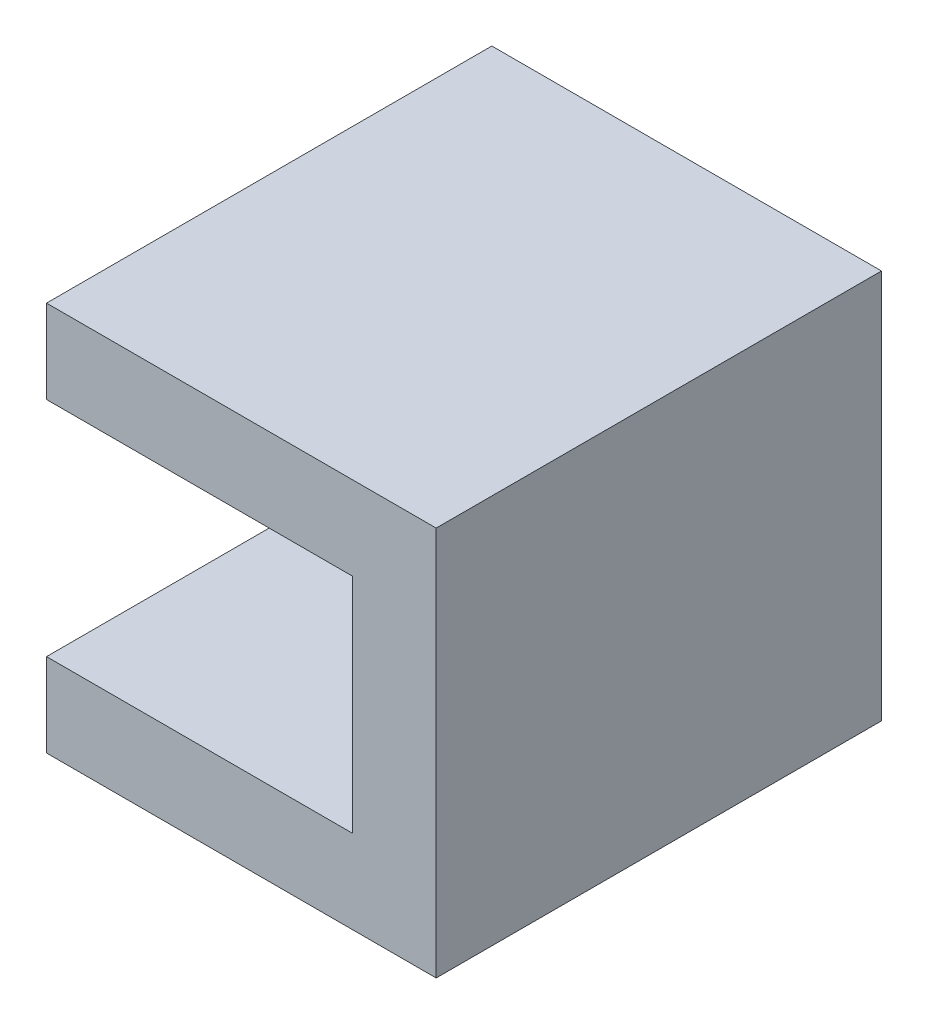
ISO-10303-21;
HEADER;
FILE_DESCRIPTION(('STEP AP214'),'2;1');
FILE_NAME('part.step','',(''),(''),'','','');
FILE_SCHEMA(('AUTOMOTIVE_DESIGN { 1 0 10303 214 1 1 1 1 }'));
ENDSEC;
DATA;
#1=APPLICATION_CONTEXT('core data for automotive mechanical design processes');
#2=APPLICATION_PROTOCOL_DEFINITION('international standard','automotive_design',2000,#1);
#3=PRODUCT_CONTEXT('',#1,'mechanical');
#4=PRODUCT('Part','Part','',(#3));
#5=PRODUCT_RELATED_PRODUCT_CATEGORY('part','',(#4));
#6=PRODUCT_DEFINITION_FORMATION('','',#4);
#7=PRODUCT_DEFINITION_CONTEXT('part definition',#1,'design');
#8=PRODUCT_DEFINITION('design','',#6,#7);
#9=PRODUCT_DEFINITION_SHAPE('','',#8);
#10=(LENGTH_UNIT() NAMED_UNIT(*) SI_UNIT(.MILLI.,.METRE.));
#11=(NAMED_UNIT(*) PLANE_ANGLE_UNIT() SI_UNIT($,.RADIAN.));
#12=(NAMED_UNIT(*) SI_UNIT($,.STERADIAN.) SOLID_ANGLE_UNIT());
#13=UNCERTAINTY_MEASURE_WITH_UNIT(LENGTH_MEASURE(1.E-05),#10,'distance_accuracy_value','');
#14=(GEOMETRIC_REPRESENTATION_CONTEXT(3) GLOBAL_UNCERTAINTY_ASSIGNED_CONTEXT((#13)) GLOBAL_UNIT_ASSIGNED_CONTEXT((#10,
#11,#12)) REPRESENTATION_CONTEXT('',''));
#15=CARTESIAN_POINT('',(0.,0.,0.));
#16=DIRECTION('',(0.,0.,1.));
#17=DIRECTION('',(1.,0.,0.));
#18=AXIS2_PLACEMENT_3D('',#15,#16,#17);
#19=CARTESIAN_POINT('',(3.175,0.,25.4));
#20=DIRECTION('',(0.,-1.,0.));
#21=DIRECTION('',(0.,0.,-1.));
#22=AXIS2_PLACEMENT_3D('',#19,#20,#21);
#23=PLANE('',#22);
#24=DIRECTION('',(0.,0.,-1.));
#25=VECTOR('',#24,1.);
#26=CARTESIAN_POINT('',(3.175,0.,25.4));
#27=LINE('',#26,#25);
#28=CARTESIAN_POINT('',(3.175,0.,3.175));
#29=VERTEX_POINT('',#28);
#30=CARTESIAN_POINT('',(3.175,0.,-3.175));
#31=VERTEX_POINT('',#30);
#32=EDGE_CURVE('E172',#29,#31,#27,.T.);
#33=ORIENTED_EDGE('',*,*,#32,.T.);
#34=CARTESIAN_POINT('',(3.175,0.,0.));
#35=DIRECTION('',(0.,-1.,0.));
#36=DIRECTION('',(0.,0.,1.));
#37=AXIS2_PLACEMENT_3D('',#34,#35,#36);
#38=CIRCLE('',#37,3.175);
#39=EDGE_CURVE('E234',#29,#31,#38,.T.);
#40=ORIENTED_EDGE('',*,*,#39,.F.);
#41=EDGE_LOOP('',(#33,#40));
#42=FACE_BOUND('',#41,.T.);
#43=ADVANCED_FACE('F37',(#42),#23,.F.);
#44=CARTESIAN_POINT('',(0.,-6.35,25.4));
#45=DIRECTION('',(0.,1.,0.));
#46=DIRECTION('',(0.,0.,1.));
#47=AXIS2_PLACEMENT_3D('',#44,#45,#46);
#48=PLANE('',#47);
#49=CARTESIAN_POINT('',(3.175,-6.35,0.));
#50=DIRECTION('',(0.,1.,0.));
#51=DIRECTION('',(0.,0.,1.));
#52=AXIS2_PLACEMENT_3D('',#49,#50,#51);
#53=CIRCLE('',#52,3.175);
#54=CARTESIAN_POINT('',(3.175,-6.35,-3.175));
#55=VERTEX_POINT('',#54);
#56=CARTESIAN_POINT('',(3.175,-6.35,3.175));
#57=VERTEX_POINT('',#56);
#58=EDGE_CURVE('E228',#55,#57,#53,.T.);
#59=ORIENTED_EDGE('',*,*,#58,.F.);
#60=DIRECTION('',(0.,0.,-1.));
#61=VECTOR('',#60,1.);
#62=CARTESIAN_POINT('',(3.175,-6.35,25.4));
#63=LINE('',#62,#61);
#64=EDGE_CURVE('E169',#57,#55,#63,.T.);
#65=ORIENTED_EDGE('',*,*,#64,.F.);
#66=EDGE_LOOP('',(#59,#65));
#67=FACE_BOUND('',#66,.T.);
#68=ADVANCED_FACE('F260',(#67),#48,.F.);
#69=CARTESIAN_POINT('',(0.,0.,-25.4));
#70=DIRECTION('',(0.,0.,1.));
#71=DIRECTION('',(1.,0.,0.));
#72=AXIS2_PLACEMENT_3D('',#69,#70,#71);
#73=PLANE('',#72);
#74=DIRECTION('',(0.,-1.,0.));
#75=VECTOR('',#74,1.);
#76=CARTESIAN_POINT('',(3.175,-6.35,-25.4));
#77=LINE('',#76,#75);
#78=CARTESIAN_POINT('',(3.175,12.7,-25.4));
#79=VERTEX_POINT('',#78);
#80=CARTESIAN_POINT('',(3.175,-12.7,-25.4));
#81=VERTEX_POINT('',#80);
#82=EDGE_CURVE('E148',#79,#81,#77,.T.);
#83=ORIENTED_EDGE('',*,*,#82,.F.);
#84=DIRECTION('',(1.,0.,0.));
#85=VECTOR('',#84,1.);
#86=CARTESIAN_POINT('',(-11.1125,12.7,-25.4));
#87=LINE('',#86,#85);
#88=CARTESIAN_POINT('',(-31.75,12.7,-25.4));
#89=VERTEX_POINT('',#88);
#90=EDGE_CURVE('E145',#89,#79,#87,.T.);
#91=ORIENTED_EDGE('',*,*,#90,.F.);
#92=DIRECTION('',(0.,-1.,0.));
#93=VECTOR('',#92,1.);
#94=CARTESIAN_POINT('',(-31.75,22.225,-25.4));
#95=LINE('',#94,#93);
#96=CARTESIAN_POINT('',(-31.75,22.225,-25.4));
#97=VERTEX_POINT('',#96);
#98=EDGE_CURVE('E141',#97,#89,#95,.T.);
#99=ORIENTED_EDGE('',*,*,#98,.F.);
#100=DIRECTION('',(-1.,0.,0.));
#101=VECTOR('',#100,1.);
#102=CARTESIAN_POINT('',(12.7,22.225,-25.4));
#103=LINE('',#102,#101);
#104=CARTESIAN_POINT('',(12.7,22.225,-25.4));
#105=VERTEX_POINT('',#104);
#106=EDGE_CURVE('E138',#105,#97,#103,.T.);
#107=ORIENTED_EDGE('',*,*,#106,.F.);
#108=DIRECTION('',(0.,1.,0.));
#109=VECTOR('',#108,1.);
#110=CARTESIAN_POINT('',(12.7,-22.225,-25.4));
#111=LINE('',#110,#109);
#112=CARTESIAN_POINT('',(12.7,-22.225,-25.4));
#113=VERTEX_POINT('',#112);
#114=EDGE_CURVE('E90',#113,#105,#111,.T.);
#115=ORIENTED_EDGE('',*,*,#114,.F.);
#116=DIRECTION('',(1.,0.,0.));
#117=VECTOR('',#116,1.);
#118=CARTESIAN_POINT('',(-31.75,-22.225,-25.4));
#119=LINE('',#118,#117);
#120=CARTESIAN_POINT('',(-31.75,-22.225,-25.4));
#121=VERTEX_POINT('',#120);
#122=EDGE_CURVE('E84',#121,#113,#119,.T.);
#123=ORIENTED_EDGE('',*,*,#122,.F.);
#124=DIRECTION('',(0.,-1.,0.));
#125=VECTOR('',#124,1.);
#126=CARTESIAN_POINT('',(-31.75,-12.7,-25.4));
#127=LINE('',#126,#125);
#128=CARTESIAN_POINT('',(-31.75,-12.7,-25.4));
#129=VERTEX_POINT('',#128);
#130=EDGE_CURVE('E128',#129,#121,#127,.T.);
#131=ORIENTED_EDGE('',*,*,#130,.F.);
#132=DIRECTION('',(-1.,0.,0.));
#133=VECTOR('',#132,1.);
#134=CARTESIAN_POINT('',(-17.4625,-12.7,-25.4));
#135=LINE('',#134,#133);
#136=EDGE_CURVE('E151',#81,#129,#135,.T.);
#137=ORIENTED_EDGE('',*,*,#136,.F.);
#138=EDGE_LOOP('',(#83,#91,#99,#107,#115,#123,#131,#137));
#139=FACE_BOUND('',#138,.T.);
#140=ADVANCED_FACE('F194',(#139),#73,.F.);
#141=CARTESIAN_POINT('',(-17.4625,12.7,25.4));
#142=DIRECTION('',(1.,0.,0.));
#143=DIRECTION('',(0.,0.,-1.));
#144=AXIS2_PLACEMENT_3D('',#141,#142,#143);
#145=PLANE('',#144);
#146=DIRECTION('',(0.,0.,-1.));
#147=VECTOR('',#146,1.);
#148=CARTESIAN_POINT('',(-17.4625,12.7,25.4));
#149=LINE('',#148,#147);
#150=CARTESIAN_POINT('',(-17.4625,12.7,3.175));
#151=VERTEX_POINT('',#150);
#152=CARTESIAN_POINT('',(-17.4625,12.7,-3.175));
#153=VERTEX_POINT('',#152);
#154=EDGE_CURVE('E181',#151,#153,#149,.T.);
#155=ORIENTED_EDGE('',*,*,#154,.T.);
#156=CARTESIAN_POINT('',(-17.4625,12.7,0.));
#157=DIRECTION('',(-1.,0.,0.));
#158=DIRECTION('',(0.,0.,1.));
#159=AXIS2_PLACEMENT_3D('',#156,#157,#158);
#160=CIRCLE('',#159,3.175);
#161=EDGE_CURVE('E217',#153,#151,#160,.T.);
#162=ORIENTED_EDGE('',*,*,#161,.T.);
#163=EDGE_LOOP('',(#155,#162));
#164=FACE_BOUND('',#163,.T.);
#165=ADVANCED_FACE('F310',(#164),#145,.F.);
#166=CARTESIAN_POINT('',(-11.1125,9.525,25.4));
#167=DIRECTION('',(-1.,0.,0.));
#168=DIRECTION('',(0.,0.,1.));
#169=AXIS2_PLACEMENT_3D('',#166,#167,#168);
#170=PLANE('',#169);
#171=CARTESIAN_POINT('',(-11.1125,12.7,0.));
#172=DIRECTION('',(-1.,0.,0.));
#173=DIRECTION('',(0.,0.,1.));
#174=AXIS2_PLACEMENT_3D('',#171,#172,#173);
#175=CIRCLE('',#174,3.175);
#176=CARTESIAN_POINT('',(-11.1125,12.7,3.175));
#177=VERTEX_POINT('',#176);
#178=CARTESIAN_POINT('',(-11.1125,12.7,-3.175));
#179=VERTEX_POINT('',#178);
#180=EDGE_CURVE('E142',#177,#179,#175,.F.);
#181=ORIENTED_EDGE('',*,*,#180,.T.);
#182=DIRECTION('',(0.,0.,-1.));
#183=VECTOR('',#182,1.);
#184=CARTESIAN_POINT('',(-11.1125,12.7,25.4));
#185=LINE('',#184,#183);
#186=EDGE_CURVE('E178',#177,#179,#185,.T.);
#187=ORIENTED_EDGE('',*,*,#186,.F.);
#188=EDGE_LOOP('',(#181,#187));
#189=FACE_BOUND('',#188,.T.);
#190=ADVANCED_FACE('F295',(#189),#170,.F.);
#191=CARTESIAN_POINT('',(-11.1125,-9.525,25.4));
#192=DIRECTION('',(-1.,0.,0.));
#193=DIRECTION('',(0.,0.,1.));
#194=AXIS2_PLACEMENT_3D('',#191,#192,#193);
#195=PLANE('',#194);
#196=DIRECTION('',(0.,0.,-1.));
#197=VECTOR('',#196,1.);
#198=CARTESIAN_POINT('',(-11.1125,-12.7,25.4));
#199=LINE('',#198,#197);
#200=CARTESIAN_POINT('',(-11.1125,-12.7,3.17500000000001));
#201=VERTEX_POINT('',#200);
#202=CARTESIAN_POINT('',(-11.1125,-12.7,-3.17500000000001));
#203=VERTEX_POINT('',#202);
#204=EDGE_CURVE('E163',#201,#203,#199,.T.);
#205=ORIENTED_EDGE('',*,*,#204,.T.);
#206=CARTESIAN_POINT('',(-11.1125,-12.7,0.));
#207=DIRECTION('',(-1.,0.,0.));
#208=DIRECTION('',(0.,0.,1.));
#209=AXIS2_PLACEMENT_3D('',#206,#207,#208);
#210=CIRCLE('',#209,3.17500000000001);
#211=EDGE_CURVE('E210',#203,#201,#210,.F.);
#212=ORIENTED_EDGE('',*,*,#211,.T.);
#213=EDGE_LOOP('',(#205,#212));
#214=FACE_BOUND('',#213,.T.);
#215=ADVANCED_FACE('F285',(#214),#195,.F.);
#216=CARTESIAN_POINT('',(-17.4625,-12.7,25.4));
#217=DIRECTION('',(1.,0.,0.));
#218=DIRECTION('',(0.,0.,-1.));
#219=AXIS2_PLACEMENT_3D('',#216,#217,#218);
#220=PLANE('',#219);
#221=CARTESIAN_POINT('',(-17.4625,-12.7,0.));
#222=DIRECTION('',(-1.,0.,0.));
#223=DIRECTION('',(0.,0.,1.));
#224=AXIS2_PLACEMENT_3D('',#221,#222,#223);
#225=CIRCLE('',#224,3.17500000000001);
#226=CARTESIAN_POINT('',(-17.4625,-12.7,3.17500000000001));
#227=VERTEX_POINT('',#226);
#228=CARTESIAN_POINT('',(-17.4625,-12.7,-3.17500000000001));
#229=VERTEX_POINT('',#228);
#230=EDGE_CURVE('E211',#227,#229,#225,.T.);
#231=ORIENTED_EDGE('',*,*,#230,.T.);
#232=DIRECTION('',(0.,0.,-1.));
#233=VECTOR('',#232,1.);
#234=CARTESIAN_POINT('',(-17.4625,-12.7,25.4));
#235=LINE('',#234,#233);
#236=EDGE_CURVE('E160',#227,#229,#235,.T.);
#237=ORIENTED_EDGE('',*,*,#236,.F.);
#238=EDGE_LOOP('',(#231,#237));
#239=FACE_BOUND('',#238,.T.);
#240=ADVANCED_FACE('F287',(#239),#220,.F.);
#241=CARTESIAN_POINT('',(12.7,22.225,25.4));
#242=DIRECTION('',(0.,-1.,0.));
#243=DIRECTION('',(1.,0.,0.));
#244=AXIS2_PLACEMENT_3D('',#241,#242,#243);
#245=PLANE('',#244);
#246=ORIENTED_EDGE('',*,*,#106,.T.);
#247=DIRECTION('',(0.,0.,-1.));
#248=VECTOR('',#247,1.);
#249=CARTESIAN_POINT('',(-31.75,22.225,25.4));
#250=LINE('',#249,#248);
#251=CARTESIAN_POINT('',(-31.75,22.225,25.4));
#252=VERTEX_POINT('',#251);
#253=EDGE_CURVE('E11',#252,#97,#250,.T.);
#254=ORIENTED_EDGE('',*,*,#253,.F.);
#255=DIRECTION('',(-1.,0.,0.));
#256=VECTOR('',#255,1.);
#257=CARTESIAN_POINT('',(12.7,22.225,25.4));
#258=LINE('',#257,#256);
#259=CARTESIAN_POINT('',(12.7,22.225,25.4));
#260=VERTEX_POINT('',#259);
#261=EDGE_CURVE('E156',#260,#252,#258,.T.);
#262=ORIENTED_EDGE('',*,*,#261,.F.);
#263=DIRECTION('',(0.,0.,-1.));
#264=VECTOR('',#263,1.);
#265=CARTESIAN_POINT('',(12.7,22.225,25.4));
#266=LINE('',#265,#264);
#267=EDGE_CURVE('E134',#260,#105,#266,.T.);
#268=ORIENTED_EDGE('',*,*,#267,.T.);
#269=EDGE_LOOP('',(#246,#254,#262,#268));
#270=FACE_BOUND('',#269,.T.);
#271=ADVANCED_FACE('F39',(#270),#245,.F.);
#272=CARTESIAN_POINT('',(-31.75,22.225,25.4));
#273=DIRECTION('',(1.,0.,0.));
#274=DIRECTION('',(0.,0.,-1.));
#275=AXIS2_PLACEMENT_3D('',#272,#273,#274);
#276=PLANE('',#275);
#277=ORIENTED_EDGE('',*,*,#98,.T.);
#278=DIRECTION('',(0.,0.,-1.));
#279=VECTOR('',#278,1.);
#280=CARTESIAN_POINT('',(-31.75,12.7,25.4));
#281=LINE('',#280,#279);
#282=CARTESIAN_POINT('',(-31.75,12.7,25.4));
#283=VERTEX_POINT('',#282);
#284=EDGE_CURVE('E46',#283,#89,#281,.T.);
#285=ORIENTED_EDGE('',*,*,#284,.F.);
#286=DIRECTION('',(0.,-1.,0.));
#287=VECTOR('',#286,1.);
#288=CARTESIAN_POINT('',(-31.75,22.225,25.4));
#289=LINE('',#288,#287);
#290=EDGE_CURVE('E98',#252,#283,#289,.T.);
#291=ORIENTED_EDGE('',*,*,#290,.F.);
#292=ORIENTED_EDGE('',*,*,#253,.T.);
#293=EDGE_LOOP('',(#277,#285,#291,#292));
#294=FACE_BOUND('',#293,.T.);
#295=ADVANCED_FACE('F190',(#294),#276,.F.);
#296=CARTESIAN_POINT('',(-11.1125,12.7,25.4));
#297=DIRECTION('',(0.,1.,0.));
#298=DIRECTION('',(-1.,0.,0.));
#299=AXIS2_PLACEMENT_3D('',#296,#297,#298);
#300=PLANE('',#299);
#301=ORIENTED_EDGE('',*,*,#284,.T.);
#302=ORIENTED_EDGE('',*,*,#90,.T.);
#303=DIRECTION('',(0.,0.,-1.));
#304=VECTOR('',#303,1.);
#305=CARTESIAN_POINT('',(3.175,12.7,25.4));
#306=LINE('',#305,#304);
#307=CARTESIAN_POINT('',(3.175,12.7,25.4));
#308=VERTEX_POINT('',#307);
#309=EDGE_CURVE('E175',#308,#79,#306,.T.);
#310=ORIENTED_EDGE('',*,*,#309,.F.);
#311=DIRECTION('',(1.,0.,0.));
#312=VECTOR('',#311,1.);
#313=CARTESIAN_POINT('',(-31.75,12.7,25.4));
#314=LINE('',#313,#312);
#315=EDGE_CURVE('E189',#283,#308,#314,.T.);
#316=ORIENTED_EDGE('',*,*,#315,.F.);
#317=EDGE_LOOP('',(#301,#302,#310,#316));
#318=FACE_BOUND('',#317,.T.);
#319=DIRECTION('',(-1.,0.,0.));
#320=VECTOR('',#319,1.);
#321=CARTESIAN_POINT('',(14.4851683508479,12.7,-3.175));
#322=LINE('',#321,#320);
#323=EDGE_CURVE('E214',#179,#153,#322,.T.);
#324=ORIENTED_EDGE('',*,*,#323,.T.);
#325=ORIENTED_EDGE('',*,*,#154,.F.);
#326=DIRECTION('',(-1.,0.,0.));
#327=VECTOR('',#326,1.);
#328=CARTESIAN_POINT('',(14.4851683508479,12.7,3.175));
#329=LINE('',#328,#327);
#330=EDGE_CURVE('E218',#177,#151,#329,.T.);
#331=ORIENTED_EDGE('',*,*,#330,.F.);
#332=ORIENTED_EDGE('',*,*,#186,.T.);
#333=EDGE_LOOP('',(#324,#325,#331,#332));
#334=FACE_BOUND('',#333,.T.);
#335=ADVANCED_FACE('F186',(#318,#334),#300,.F.);
#336=CARTESIAN_POINT('',(3.175,-6.35,25.4));
#337=DIRECTION('',(1.,0.,0.));
#338=DIRECTION('',(0.,1.,0.));
#339=AXIS2_PLACEMENT_3D('',#336,#337,#338);
#340=PLANE('',#339);
#341=DIRECTION('',(0.,1.,0.));
#342=VECTOR('',#341,1.);
#343=CARTESIAN_POINT('',(3.175,-31.9476683508479,-3.175));
#344=LINE('',#343,#342);
#345=EDGE_CURVE('E237',#55,#31,#344,.T.);
#346=ORIENTED_EDGE('',*,*,#345,.T.);
#347=ORIENTED_EDGE('',*,*,#32,.F.);
#348=DIRECTION('',(0.,1.,0.));
#349=VECTOR('',#348,1.);
#350=CARTESIAN_POINT('',(3.175,-31.9476683508479,3.175));
#351=LINE('',#350,#349);
#352=EDGE_CURVE('E231',#57,#29,#351,.T.);
#353=ORIENTED_EDGE('',*,*,#352,.F.);
#354=ORIENTED_EDGE('',*,*,#64,.T.);
#355=EDGE_LOOP('',(#346,#347,#353,#354));
#356=FACE_BOUND('',#355,.T.);
#357=ORIENTED_EDGE('',*,*,#82,.T.);
#358=DIRECTION('',(0.,0.,-1.));
#359=VECTOR('',#358,1.);
#360=CARTESIAN_POINT('',(3.175,-12.7,25.4));
#361=LINE('',#360,#359);
#362=CARTESIAN_POINT('',(3.175,-12.7,25.4));
#363=VERTEX_POINT('',#362);
#364=EDGE_CURVE('E166',#363,#81,#361,.T.);
#365=ORIENTED_EDGE('',*,*,#364,.F.);
#366=DIRECTION('',(0.,-1.,0.));
#367=VECTOR('',#366,1.);
#368=CARTESIAN_POINT('',(3.175,12.7,25.4));
#369=LINE('',#368,#367);
#370=EDGE_CURVE('E201',#308,#363,#369,.T.);
#371=ORIENTED_EDGE('',*,*,#370,.F.);
#372=ORIENTED_EDGE('',*,*,#309,.T.);
#373=EDGE_LOOP('',(#357,#365,#371,#372));
#374=FACE_BOUND('',#373,.T.);
#375=ADVANCED_FACE('F197',(#356,#374),#340,.F.);
#376=CARTESIAN_POINT('',(-17.4625,-12.7,25.4));
#377=DIRECTION('',(0.,-1.,0.));
#378=DIRECTION('',(1.,0.,0.));
#379=AXIS2_PLACEMENT_3D('',#376,#377,#378);
#380=PLANE('',#379);
#381=ORIENTED_EDGE('',*,*,#236,.T.);
#382=DIRECTION('',(-1.,0.,0.));
#383=VECTOR('',#382,1.);
#384=CARTESIAN_POINT('',(14.4851683508479,-12.7,-3.17500000000001));
#385=LINE('',#384,#383);
#386=EDGE_CURVE('E225',#203,#229,#385,.T.);
#387=ORIENTED_EDGE('',*,*,#386,.F.);
#388=ORIENTED_EDGE('',*,*,#204,.F.);
#389=DIRECTION('',(-1.,0.,0.));
#390=VECTOR('',#389,1.);
#391=CARTESIAN_POINT('',(14.4851683508479,-12.7,3.17500000000001));
#392=LINE('',#391,#390);
#393=EDGE_CURVE('E207',#201,#227,#392,.T.);
#394=ORIENTED_EDGE('',*,*,#393,.T.);
#395=EDGE_LOOP('',(#381,#387,#388,#394));
#396=FACE_BOUND('',#395,.T.);
#397=ORIENTED_EDGE('',*,*,#136,.T.);
#398=DIRECTION('',(0.,0.,-1.));
#399=VECTOR('',#398,1.);
#400=CARTESIAN_POINT('',(-31.75,-12.7,25.4));
#401=LINE('',#400,#399);
#402=CARTESIAN_POINT('',(-31.75,-12.7,25.4));
#403=VERTEX_POINT('',#402);
#404=EDGE_CURVE('E129',#403,#129,#401,.T.);
#405=ORIENTED_EDGE('',*,*,#404,.F.);
#406=DIRECTION('',(-1.,0.,0.));
#407=VECTOR('',#406,1.);
#408=CARTESIAN_POINT('',(3.175,-12.7,25.4));
#409=LINE('',#408,#407);
#410=EDGE_CURVE('E120',#363,#403,#409,.T.);
#411=ORIENTED_EDGE('',*,*,#410,.F.);
#412=ORIENTED_EDGE('',*,*,#364,.T.);
#413=EDGE_LOOP('',(#397,#405,#411,#412));
#414=FACE_BOUND('',#413,.T.);
#415=ADVANCED_FACE('F200',(#396,#414),#380,.F.);
#416=CARTESIAN_POINT('',(-31.75,-12.7,25.4));
#417=DIRECTION('',(1.,0.,0.));
#418=DIRECTION('',(0.,1.,0.));
#419=AXIS2_PLACEMENT_3D('',#416,#417,#418);
#420=PLANE('',#419);
#421=ORIENTED_EDGE('',*,*,#130,.T.);
#422=DIRECTION('',(0.,0.,-1.));
#423=VECTOR('',#422,1.);
#424=CARTESIAN_POINT('',(-31.75,-22.225,25.4));
#425=LINE('',#424,#423);
#426=CARTESIAN_POINT('',(-31.75,-22.225,25.4));
#427=VERTEX_POINT('',#426);
#428=EDGE_CURVE('E125',#427,#121,#425,.T.);
#429=ORIENTED_EDGE('',*,*,#428,.F.);
#430=DIRECTION('',(0.,-1.,0.));
#431=VECTOR('',#430,1.);
#432=CARTESIAN_POINT('',(-31.75,-12.7,25.4));
#433=LINE('',#432,#431);
#434=EDGE_CURVE('E114',#403,#427,#433,.T.);
#435=ORIENTED_EDGE('',*,*,#434,.F.);
#436=ORIENTED_EDGE('',*,*,#404,.T.);
#437=EDGE_LOOP('',(#421,#429,#435,#436));
#438=FACE_BOUND('',#437,.T.);
#439=ADVANCED_FACE('F126',(#438),#420,.F.);
#440=CARTESIAN_POINT('',(-31.75,-22.225,25.4));
#441=DIRECTION('',(0.,1.,0.));
#442=DIRECTION('',(-1.,0.,0.));
#443=AXIS2_PLACEMENT_3D('',#440,#441,#442);
#444=PLANE('',#443);
#445=ORIENTED_EDGE('',*,*,#122,.T.);
#446=DIRECTION('',(0.,0.,-1.));
#447=VECTOR('',#446,1.);
#448=CARTESIAN_POINT('',(12.7,-22.225,25.4));
#449=LINE('',#448,#447);
#450=CARTESIAN_POINT('',(12.7,-22.225,25.4));
#451=VERTEX_POINT('',#450);
#452=EDGE_CURVE('E130',#451,#113,#449,.T.);
#453=ORIENTED_EDGE('',*,*,#452,.F.);
#454=DIRECTION('',(1.,0.,0.));
#455=VECTOR('',#454,1.);
#456=CARTESIAN_POINT('',(-31.75,-22.225,25.4));
#457=LINE('',#456,#455);
#458=EDGE_CURVE('E118',#427,#451,#457,.T.);
#459=ORIENTED_EDGE('',*,*,#458,.F.);
#460=ORIENTED_EDGE('',*,*,#428,.T.);
#461=EDGE_LOOP('',(#445,#453,#459,#460));
#462=FACE_BOUND('',#461,.T.);
#463=ADVANCED_FACE('F132',(#462),#444,.F.);
#464=CARTESIAN_POINT('',(12.7,-22.225,25.4));
#465=DIRECTION('',(-1.,0.,0.));
#466=DIRECTION('',(0.,-1.,0.));
#467=AXIS2_PLACEMENT_3D('',#464,#465,#466);
#468=PLANE('',#467);
#469=ORIENTED_EDGE('',*,*,#114,.T.);
#470=ORIENTED_EDGE('',*,*,#267,.F.);
#471=DIRECTION('',(0.,1.,0.));
#472=VECTOR('',#471,1.);
#473=CARTESIAN_POINT('',(12.7,-22.225,25.4));
#474=LINE('',#473,#472);
#475=EDGE_CURVE('E54',#451,#260,#474,.T.);
#476=ORIENTED_EDGE('',*,*,#475,.F.);
#477=ORIENTED_EDGE('',*,*,#452,.T.);
#478=EDGE_LOOP('',(#469,#470,#476,#477));
#479=FACE_BOUND('',#478,.T.);
#480=ADVANCED_FACE('F348',(#479),#468,.F.);
#481=CARTESIAN_POINT('',(0.,0.,25.4));
#482=DIRECTION('',(0.,0.,1.));
#483=DIRECTION('',(1.,0.,0.));
#484=AXIS2_PLACEMENT_3D('',#481,#482,#483);
#485=PLANE('',#484);
#486=ORIENTED_EDGE('',*,*,#370,.T.);
#487=ORIENTED_EDGE('',*,*,#410,.T.);
#488=ORIENTED_EDGE('',*,*,#434,.T.);
#489=ORIENTED_EDGE('',*,*,#458,.T.);
#490=ORIENTED_EDGE('',*,*,#475,.T.);
#491=ORIENTED_EDGE('',*,*,#261,.T.);
#492=ORIENTED_EDGE('',*,*,#290,.T.);
#493=ORIENTED_EDGE('',*,*,#315,.T.);
#494=EDGE_LOOP('',(#486,#487,#488,#489,#490,#491,#492,#493));
#495=FACE_BOUND('',#494,.T.);
#496=ADVANCED_FACE('F116',(#495),#485,.T.);
#497=CARTESIAN_POINT('',(14.4851683508479,-12.7,0.));
#498=DIRECTION('',(-1.,0.,0.));
#499=DIRECTION('',(0.,0.,1.));
#500=AXIS2_PLACEMENT_3D('',#497,#498,#499);
#501=CYLINDRICAL_SURFACE('',#500,3.17500000000001);
#502=ORIENTED_EDGE('',*,*,#211,.F.);
#503=ORIENTED_EDGE('',*,*,#386,.T.);
#504=ORIENTED_EDGE('',*,*,#230,.F.);
#505=ORIENTED_EDGE('',*,*,#393,.F.);
#506=EDGE_LOOP('',(#502,#503,#504,#505));
#507=FACE_BOUND('',#506,.T.);
#508=ADVANCED_FACE('F281',(#507),#501,.T.);
#509=CARTESIAN_POINT('',(14.4851683508479,12.7,0.));
#510=DIRECTION('',(-1.,0.,0.));
#511=DIRECTION('',(0.,0.,1.));
#512=AXIS2_PLACEMENT_3D('',#509,#510,#511);
#513=CYLINDRICAL_SURFACE('',#512,3.175);
#514=ORIENTED_EDGE('',*,*,#330,.T.);
#515=ORIENTED_EDGE('',*,*,#161,.F.);
#516=ORIENTED_EDGE('',*,*,#323,.F.);
#517=ORIENTED_EDGE('',*,*,#180,.F.);
#518=EDGE_LOOP('',(#514,#515,#516,#517));
#519=FACE_BOUND('',#518,.T.);
#520=ADVANCED_FACE('F368',(#519),#513,.T.);
#521=CARTESIAN_POINT('',(3.175,-31.9476683508479,0.));
#522=DIRECTION('',(0.,1.,0.));
#523=DIRECTION('',(0.,0.,1.));
#524=AXIS2_PLACEMENT_3D('',#521,#522,#523);
#525=CYLINDRICAL_SURFACE('',#524,3.175);
#526=ORIENTED_EDGE('',*,*,#58,.T.);
#527=ORIENTED_EDGE('',*,*,#352,.T.);
#528=ORIENTED_EDGE('',*,*,#39,.T.);
#529=ORIENTED_EDGE('',*,*,#345,.F.);
#530=EDGE_LOOP('',(#526,#527,#528,#529));
#531=FACE_BOUND('',#530,.T.);
#532=ADVANCED_FACE('F255',(#531),#525,.T.);
#533=CLOSED_SHELL('',(#43,#68,#140,#165,#190,#215,#240,#271,#295,#335,#375,#415,#439,#463,#480,
#496,#508,#520,#532));
#534=MANIFOLD_SOLID_BREP('B2',#533);
#535=ADVANCED_BREP_SHAPE_REPRESENTATION('',(#18,#534),#14);
#536=SHAPE_DEFINITION_REPRESENTATION(#9,#535);
ENDSEC;
END-ISO-10303-21;
